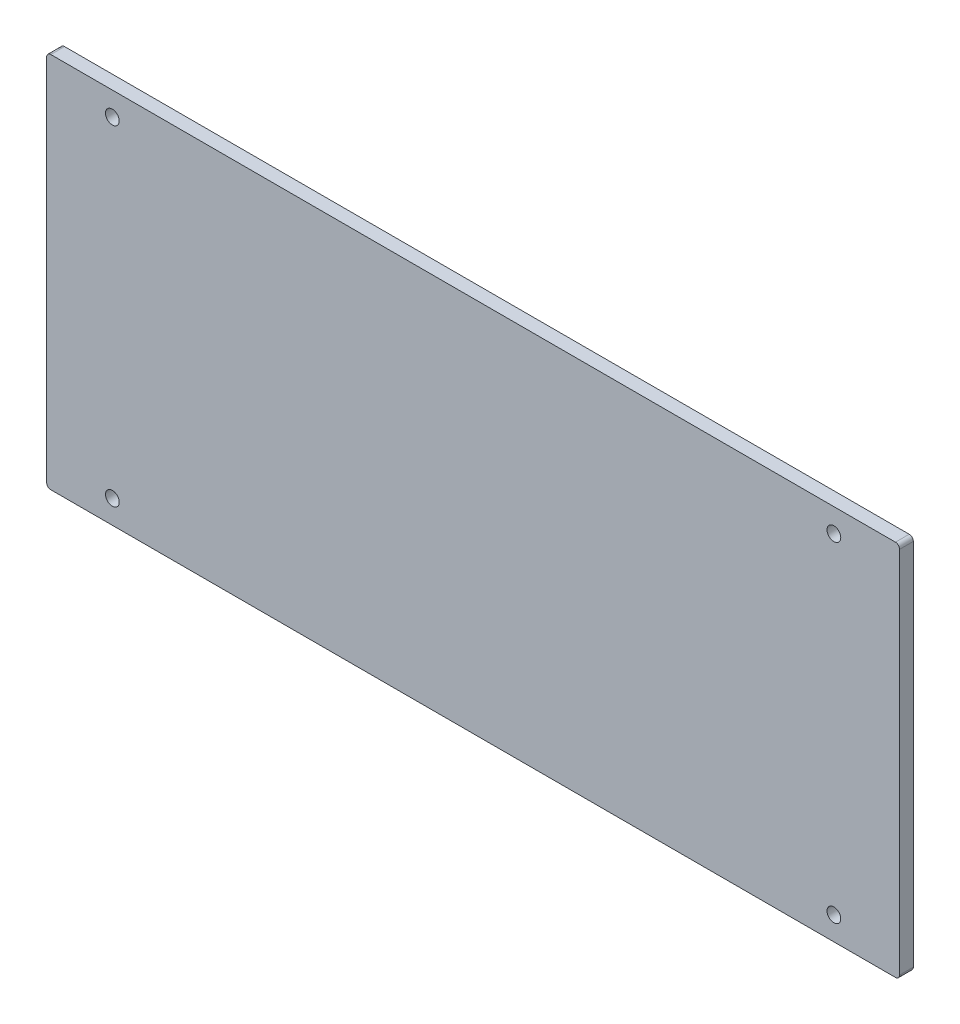
ISO-10303-21;
HEADER;
FILE_DESCRIPTION(('STEP AP214'),'2;1');
FILE_NAME('part.step','',(''),(''),'','','');
FILE_SCHEMA(('AUTOMOTIVE_DESIGN { 1 0 10303 214 1 1 1 1 }'));
ENDSEC;
DATA;
#1=APPLICATION_CONTEXT('core data for automotive mechanical design processes');
#2=APPLICATION_PROTOCOL_DEFINITION('international standard','automotive_design',2000,#1);
#3=PRODUCT_CONTEXT('',#1,'mechanical');
#4=PRODUCT('Part','Part','',(#3));
#5=PRODUCT_RELATED_PRODUCT_CATEGORY('part','',(#4));
#6=PRODUCT_DEFINITION_FORMATION('','',#4);
#7=PRODUCT_DEFINITION_CONTEXT('part definition',#1,'design');
#8=PRODUCT_DEFINITION('design','',#6,#7);
#9=PRODUCT_DEFINITION_SHAPE('','',#8);
#10=(LENGTH_UNIT() NAMED_UNIT(*) SI_UNIT(.MILLI.,.METRE.));
#11=(NAMED_UNIT(*) PLANE_ANGLE_UNIT() SI_UNIT($,.RADIAN.));
#12=(NAMED_UNIT(*) SI_UNIT($,.STERADIAN.) SOLID_ANGLE_UNIT());
#13=UNCERTAINTY_MEASURE_WITH_UNIT(LENGTH_MEASURE(1.E-05),#10,'distance_accuracy_value','');
#14=(GEOMETRIC_REPRESENTATION_CONTEXT(3) GLOBAL_UNCERTAINTY_ASSIGNED_CONTEXT((#13)) GLOBAL_UNIT_ASSIGNED_CONTEXT((#10,
#11,#12)) REPRESENTATION_CONTEXT('',''));
#15=CARTESIAN_POINT('',(0.,0.,0.));
#16=DIRECTION('',(0.,0.,1.));
#17=DIRECTION('',(1.,0.,0.));
#18=AXIS2_PLACEMENT_3D('',#15,#16,#17);
#19=CARTESIAN_POINT('',(-153.5,-67.,5.));
#20=DIRECTION('',(0.,0.,-1.));
#21=DIRECTION('',(-1.,0.,0.));
#22=AXIS2_PLACEMENT_3D('',#19,#20,#21);
#23=CYLINDRICAL_SURFACE('',#22,1.5);
#24=CARTESIAN_POINT('',(-153.5,-67.,0.));
#25=DIRECTION('',(0.,0.,1.));
#26=DIRECTION('',(-1.,0.,0.));
#27=AXIS2_PLACEMENT_3D('',#24,#25,#26);
#28=CIRCLE('',#27,1.5);
#29=CARTESIAN_POINT('',(-155.,-67.,0.));
#30=VERTEX_POINT('',#29);
#31=CARTESIAN_POINT('',(-153.5,-68.5,0.));
#32=VERTEX_POINT('',#31);
#33=EDGE_CURVE('E142',#30,#32,#28,.T.);
#34=ORIENTED_EDGE('',*,*,#33,.T.);
#35=DIRECTION('',(0.,0.,-1.));
#36=VECTOR('',#35,1.);
#37=CARTESIAN_POINT('',(-153.5,-68.5,5.));
#38=LINE('',#37,#36);
#39=CARTESIAN_POINT('',(-153.5,-68.5,5.));
#40=VERTEX_POINT('',#39);
#41=EDGE_CURVE('E11',#40,#32,#38,.T.);
#42=ORIENTED_EDGE('',*,*,#41,.F.);
#43=CARTESIAN_POINT('',(-153.5,-67.,5.));
#44=DIRECTION('',(0.,0.,1.));
#45=DIRECTION('',(-1.,0.,0.));
#46=AXIS2_PLACEMENT_3D('',#43,#44,#45);
#47=CIRCLE('',#46,1.5);
#48=CARTESIAN_POINT('',(-155.,-67.,5.));
#49=VERTEX_POINT('',#48);
#50=EDGE_CURVE('E161',#49,#40,#47,.T.);
#51=ORIENTED_EDGE('',*,*,#50,.F.);
#52=DIRECTION('',(0.,0.,-1.));
#53=VECTOR('',#52,1.);
#54=CARTESIAN_POINT('',(-155.,-67.,5.));
#55=LINE('',#54,#53);
#56=EDGE_CURVE('E138',#49,#30,#55,.T.);
#57=ORIENTED_EDGE('',*,*,#56,.T.);
#58=EDGE_LOOP('',(#34,#42,#51,#57));
#59=FACE_BOUND('',#58,.T.);
#60=ADVANCED_FACE('F39',(#59),#23,.T.);
#61=CARTESIAN_POINT('',(-153.5,-68.5,5.));
#62=DIRECTION('',(0.,1.,0.));
#63=DIRECTION('',(0.,0.,1.));
#64=AXIS2_PLACEMENT_3D('',#61,#62,#63);
#65=PLANE('',#64);
#66=DIRECTION('',(1.,0.,0.));
#67=VECTOR('',#66,1.);
#68=CARTESIAN_POINT('',(-153.5,-68.5,0.));
#69=LINE('',#68,#67);
#70=CARTESIAN_POINT('',(153.5,-68.5,0.));
#71=VERTEX_POINT('',#70);
#72=EDGE_CURVE('E146',#32,#71,#69,.T.);
#73=ORIENTED_EDGE('',*,*,#72,.T.);
#74=DIRECTION('',(0.,0.,-1.));
#75=VECTOR('',#74,1.);
#76=CARTESIAN_POINT('',(153.5,-68.5,5.));
#77=LINE('',#76,#75);
#78=CARTESIAN_POINT('',(153.5,-68.5,5.));
#79=VERTEX_POINT('',#78);
#80=EDGE_CURVE('E48',#79,#71,#77,.T.);
#81=ORIENTED_EDGE('',*,*,#80,.F.);
#82=DIRECTION('',(1.,0.,0.));
#83=VECTOR('',#82,1.);
#84=CARTESIAN_POINT('',(-153.5,-68.5,5.));
#85=LINE('',#84,#83);
#86=EDGE_CURVE('E103',#40,#79,#85,.T.);
#87=ORIENTED_EDGE('',*,*,#86,.F.);
#88=ORIENTED_EDGE('',*,*,#41,.T.);
#89=EDGE_LOOP('',(#73,#81,#87,#88));
#90=FACE_BOUND('',#89,.T.);
#91=ADVANCED_FACE('F248',(#90),#65,.F.);
#92=CARTESIAN_POINT('',(153.5,-67.,5.));
#93=DIRECTION('',(0.,0.,-1.));
#94=DIRECTION('',(-1.,0.,0.));
#95=AXIS2_PLACEMENT_3D('',#92,#93,#94);
#96=CYLINDRICAL_SURFACE('',#95,1.5);
#97=CARTESIAN_POINT('',(153.5,-67.,0.));
#98=DIRECTION('',(0.,0.,1.));
#99=DIRECTION('',(1.,0.,0.));
#100=AXIS2_PLACEMENT_3D('',#97,#98,#99);
#101=CIRCLE('',#100,1.5);
#102=CARTESIAN_POINT('',(155.,-67.,0.));
#103=VERTEX_POINT('',#102);
#104=EDGE_CURVE('E150',#71,#103,#101,.T.);
#105=ORIENTED_EDGE('',*,*,#104,.T.);
#106=DIRECTION('',(0.,0.,-1.));
#107=VECTOR('',#106,1.);
#108=CARTESIAN_POINT('',(155.,-67.,5.));
#109=LINE('',#108,#107);
#110=CARTESIAN_POINT('',(155.,-67.,5.));
#111=VERTEX_POINT('',#110);
#112=EDGE_CURVE('E169',#111,#103,#109,.T.);
#113=ORIENTED_EDGE('',*,*,#112,.F.);
#114=CARTESIAN_POINT('',(153.5,-67.,5.));
#115=DIRECTION('',(0.,0.,1.));
#116=DIRECTION('',(1.,0.,0.));
#117=AXIS2_PLACEMENT_3D('',#114,#115,#116);
#118=CIRCLE('',#117,1.5);
#119=EDGE_CURVE('E177',#79,#111,#118,.T.);
#120=ORIENTED_EDGE('',*,*,#119,.F.);
#121=ORIENTED_EDGE('',*,*,#80,.T.);
#122=EDGE_LOOP('',(#105,#113,#120,#121));
#123=FACE_BOUND('',#122,.T.);
#124=ADVANCED_FACE('F175',(#123),#96,.T.);
#125=CARTESIAN_POINT('',(155.,-67.,5.));
#126=DIRECTION('',(-1.,0.,0.));
#127=DIRECTION('',(0.,0.,1.));
#128=AXIS2_PLACEMENT_3D('',#125,#126,#127);
#129=PLANE('',#128);
#130=DIRECTION('',(0.,1.,0.));
#131=VECTOR('',#130,1.);
#132=CARTESIAN_POINT('',(155.,-67.,0.));
#133=LINE('',#132,#131);
#134=CARTESIAN_POINT('',(155.,67.,0.));
#135=VERTEX_POINT('',#134);
#136=EDGE_CURVE('E152',#103,#135,#133,.T.);
#137=ORIENTED_EDGE('',*,*,#136,.T.);
#138=DIRECTION('',(0.,0.,-1.));
#139=VECTOR('',#138,1.);
#140=CARTESIAN_POINT('',(155.,67.,5.));
#141=LINE('',#140,#139);
#142=CARTESIAN_POINT('',(155.,67.,5.));
#143=VERTEX_POINT('',#142);
#144=EDGE_CURVE('E166',#143,#135,#141,.T.);
#145=ORIENTED_EDGE('',*,*,#144,.F.);
#146=DIRECTION('',(0.,1.,0.));
#147=VECTOR('',#146,1.);
#148=CARTESIAN_POINT('',(155.,-67.,5.));
#149=LINE('',#148,#147);
#150=EDGE_CURVE('E189',#111,#143,#149,.T.);
#151=ORIENTED_EDGE('',*,*,#150,.F.);
#152=ORIENTED_EDGE('',*,*,#112,.T.);
#153=EDGE_LOOP('',(#137,#145,#151,#152));
#154=FACE_BOUND('',#153,.T.);
#155=ADVANCED_FACE('F185',(#154),#129,.F.);
#156=CARTESIAN_POINT('',(153.5,67.,5.));
#157=DIRECTION('',(0.,0.,-1.));
#158=DIRECTION('',(-1.,0.,0.));
#159=AXIS2_PLACEMENT_3D('',#156,#157,#158);
#160=CYLINDRICAL_SURFACE('',#159,1.5);
#161=CARTESIAN_POINT('',(153.5,67.,0.));
#162=DIRECTION('',(0.,0.,1.));
#163=DIRECTION('',(-1.,0.,0.));
#164=AXIS2_PLACEMENT_3D('',#161,#162,#163);
#165=CIRCLE('',#164,1.5);
#166=CARTESIAN_POINT('',(153.5,68.5,0.));
#167=VERTEX_POINT('',#166);
#168=EDGE_CURVE('E154',#135,#167,#165,.T.);
#169=ORIENTED_EDGE('',*,*,#168,.T.);
#170=DIRECTION('',(0.,0.,-1.));
#171=VECTOR('',#170,1.);
#172=CARTESIAN_POINT('',(153.5,68.5,5.));
#173=LINE('',#172,#171);
#174=CARTESIAN_POINT('',(153.5,68.5,5.));
#175=VERTEX_POINT('',#174);
#176=EDGE_CURVE('E132',#175,#167,#173,.T.);
#177=ORIENTED_EDGE('',*,*,#176,.F.);
#178=CARTESIAN_POINT('',(153.5,67.,5.));
#179=DIRECTION('',(0.,0.,1.));
#180=DIRECTION('',(-1.,0.,0.));
#181=AXIS2_PLACEMENT_3D('',#178,#179,#180);
#182=CIRCLE('',#181,1.5);
#183=EDGE_CURVE('E122',#143,#175,#182,.T.);
#184=ORIENTED_EDGE('',*,*,#183,.F.);
#185=ORIENTED_EDGE('',*,*,#144,.T.);
#186=EDGE_LOOP('',(#169,#177,#184,#185));
#187=FACE_BOUND('',#186,.T.);
#188=ADVANCED_FACE('F188',(#187),#160,.T.);
#189=CARTESIAN_POINT('',(-153.5,68.5,5.));
#190=DIRECTION('',(0.,-1.,0.));
#191=DIRECTION('',(0.,0.,-1.));
#192=AXIS2_PLACEMENT_3D('',#189,#190,#191);
#193=PLANE('',#192);
#194=DIRECTION('',(-1.,0.,0.));
#195=VECTOR('',#194,1.);
#196=CARTESIAN_POINT('',(-153.5,68.5,0.));
#197=LINE('',#196,#195);
#198=CARTESIAN_POINT('',(-153.5,68.5,0.));
#199=VERTEX_POINT('',#198);
#200=EDGE_CURVE('E131',#167,#199,#197,.T.);
#201=ORIENTED_EDGE('',*,*,#200,.T.);
#202=DIRECTION('',(0.,0.,-1.));
#203=VECTOR('',#202,1.);
#204=CARTESIAN_POINT('',(-153.5,68.5,5.));
#205=LINE('',#204,#203);
#206=CARTESIAN_POINT('',(-153.5,68.5,5.));
#207=VERTEX_POINT('',#206);
#208=EDGE_CURVE('E128',#207,#199,#205,.T.);
#209=ORIENTED_EDGE('',*,*,#208,.F.);
#210=DIRECTION('',(-1.,0.,0.));
#211=VECTOR('',#210,1.);
#212=CARTESIAN_POINT('',(-153.5,68.5,5.));
#213=LINE('',#212,#211);
#214=EDGE_CURVE('E116',#175,#207,#213,.T.);
#215=ORIENTED_EDGE('',*,*,#214,.F.);
#216=ORIENTED_EDGE('',*,*,#176,.T.);
#217=EDGE_LOOP('',(#201,#209,#215,#216));
#218=FACE_BOUND('',#217,.T.);
#219=ADVANCED_FACE('F129',(#218),#193,.F.);
#220=CARTESIAN_POINT('',(-153.5,67.,5.));
#221=DIRECTION('',(0.,0.,-1.));
#222=DIRECTION('',(-1.,0.,0.));
#223=AXIS2_PLACEMENT_3D('',#220,#221,#222);
#224=CYLINDRICAL_SURFACE('',#223,1.5);
#225=CARTESIAN_POINT('',(-153.5,67.,0.));
#226=DIRECTION('',(0.,0.,1.));
#227=DIRECTION('',(-1.,0.,0.));
#228=AXIS2_PLACEMENT_3D('',#225,#226,#227);
#229=CIRCLE('',#228,1.5);
#230=CARTESIAN_POINT('',(-155.,67.,0.));
#231=VERTEX_POINT('',#230);
#232=EDGE_CURVE('E88',#199,#231,#229,.T.);
#233=ORIENTED_EDGE('',*,*,#232,.T.);
#234=DIRECTION('',(0.,0.,-1.));
#235=VECTOR('',#234,1.);
#236=CARTESIAN_POINT('',(-155.,67.,5.));
#237=LINE('',#236,#235);
#238=CARTESIAN_POINT('',(-155.,67.,5.));
#239=VERTEX_POINT('',#238);
#240=EDGE_CURVE('E133',#239,#231,#237,.T.);
#241=ORIENTED_EDGE('',*,*,#240,.F.);
#242=CARTESIAN_POINT('',(-153.5,67.,5.));
#243=DIRECTION('',(0.,0.,1.));
#244=DIRECTION('',(-1.,0.,0.));
#245=AXIS2_PLACEMENT_3D('',#242,#243,#244);
#246=CIRCLE('',#245,1.5);
#247=EDGE_CURVE('E120',#207,#239,#246,.T.);
#248=ORIENTED_EDGE('',*,*,#247,.F.);
#249=ORIENTED_EDGE('',*,*,#208,.T.);
#250=EDGE_LOOP('',(#233,#241,#248,#249));
#251=FACE_BOUND('',#250,.T.);
#252=ADVANCED_FACE('F135',(#251),#224,.T.);
#253=CARTESIAN_POINT('',(-155.,-67.,5.));
#254=DIRECTION('',(1.,0.,0.));
#255=DIRECTION('',(0.,0.,-1.));
#256=AXIS2_PLACEMENT_3D('',#253,#254,#255);
#257=PLANE('',#256);
#258=DIRECTION('',(0.,-1.,0.));
#259=VECTOR('',#258,1.);
#260=CARTESIAN_POINT('',(-155.,-67.,0.));
#261=LINE('',#260,#259);
#262=EDGE_CURVE('E95',#231,#30,#261,.T.);
#263=ORIENTED_EDGE('',*,*,#262,.T.);
#264=ORIENTED_EDGE('',*,*,#56,.F.);
#265=DIRECTION('',(0.,-1.,0.));
#266=VECTOR('',#265,1.);
#267=CARTESIAN_POINT('',(-155.,-67.,5.));
#268=LINE('',#267,#266);
#269=EDGE_CURVE('E59',#239,#49,#268,.T.);
#270=ORIENTED_EDGE('',*,*,#269,.F.);
#271=ORIENTED_EDGE('',*,*,#240,.T.);
#272=EDGE_LOOP('',(#263,#264,#270,#271));
#273=FACE_BOUND('',#272,.T.);
#274=ADVANCED_FACE('F255',(#273),#257,.F.);
#275=CARTESIAN_POINT('',(-153.5,-67.,5.));
#276=DIRECTION('',(0.,0.,-1.));
#277=DIRECTION('',(-1.,0.,0.));
#278=AXIS2_PLACEMENT_3D('',#275,#276,#277);
#279=PLANE('',#278);
#280=CARTESIAN_POINT('',(-131.119201541393,-60.0000000000007,5.));
#281=DIRECTION('',(0.,0.,-1.));
#282=DIRECTION('',(1.,0.,0.));
#283=AXIS2_PLACEMENT_3D('',#280,#281,#282);
#284=CIRCLE('',#283,2.49999999999936);
#285=CARTESIAN_POINT('',(-128.619201541394,-60.0000000000007,5.));
#286=VERTEX_POINT('',#285);
#287=EDGE_CURVE('E207',#286,#286,#284,.T.);
#288=ORIENTED_EDGE('',*,*,#287,.T.);
#289=EDGE_LOOP('',(#288));
#290=FACE_BOUND('',#289,.T.);
#291=CARTESIAN_POINT('',(-131.119201541393,60.0000000000007,5.));
#292=DIRECTION('',(0.,0.,-1.));
#293=DIRECTION('',(-1.,0.,0.));
#294=AXIS2_PLACEMENT_3D('',#291,#292,#293);
#295=CIRCLE('',#294,2.50000000000064);
#296=CARTESIAN_POINT('',(-133.619201541394,60.0000000000007,5.));
#297=VERTEX_POINT('',#296);
#298=EDGE_CURVE('E214',#297,#297,#295,.T.);
#299=ORIENTED_EDGE('',*,*,#298,.T.);
#300=EDGE_LOOP('',(#299));
#301=FACE_BOUND('',#300,.T.);
#302=CARTESIAN_POINT('',(131.119201541393,60.0000000000007,5.));
#303=DIRECTION('',(0.,0.,-1.));
#304=DIRECTION('',(1.,0.,0.));
#305=AXIS2_PLACEMENT_3D('',#302,#303,#304);
#306=CIRCLE('',#305,2.5);
#307=CARTESIAN_POINT('',(133.619201541393,60.0000000000007,5.));
#308=VERTEX_POINT('',#307);
#309=EDGE_CURVE('E200',#308,#308,#306,.T.);
#310=ORIENTED_EDGE('',*,*,#309,.T.);
#311=EDGE_LOOP('',(#310));
#312=FACE_BOUND('',#311,.T.);
#313=CARTESIAN_POINT('',(131.119201541393,-60.0000000000006,5.));
#314=DIRECTION('',(0.,0.,-1.));
#315=DIRECTION('',(-1.,0.,0.));
#316=AXIS2_PLACEMENT_3D('',#313,#314,#315);
#317=CIRCLE('',#316,2.5);
#318=CARTESIAN_POINT('',(128.619201541393,-60.0000000000006,5.));
#319=VERTEX_POINT('',#318);
#320=EDGE_CURVE('E147',#319,#319,#317,.T.);
#321=ORIENTED_EDGE('',*,*,#320,.T.);
#322=EDGE_LOOP('',(#321));
#323=FACE_BOUND('',#322,.T.);
#324=ORIENTED_EDGE('',*,*,#50,.T.);
#325=ORIENTED_EDGE('',*,*,#86,.T.);
#326=ORIENTED_EDGE('',*,*,#119,.T.);
#327=ORIENTED_EDGE('',*,*,#150,.T.);
#328=ORIENTED_EDGE('',*,*,#183,.T.);
#329=ORIENTED_EDGE('',*,*,#214,.T.);
#330=ORIENTED_EDGE('',*,*,#247,.T.);
#331=ORIENTED_EDGE('',*,*,#269,.T.);
#332=EDGE_LOOP('',(#324,#325,#326,#327,#328,#329,#330,#331));
#333=FACE_BOUND('',#332,.T.);
#334=ADVANCED_FACE('F118',(#290,#301,#312,#323,#333),#279,.F.);
#335=CARTESIAN_POINT('',(-153.5,-67.,0.));
#336=DIRECTION('',(0.,0.,-1.));
#337=DIRECTION('',(-1.,0.,0.));
#338=AXIS2_PLACEMENT_3D('',#335,#336,#337);
#339=PLANE('',#338);
#340=CARTESIAN_POINT('',(-131.119201541393,-60.0000000000007,0.));
#341=DIRECTION('',(0.,0.,-1.));
#342=DIRECTION('',(1.,0.,0.));
#343=AXIS2_PLACEMENT_3D('',#340,#341,#342);
#344=CIRCLE('',#343,2.49999999999936);
#345=CARTESIAN_POINT('',(-128.619201541394,-60.0000000000007,0.));
#346=VERTEX_POINT('',#345);
#347=EDGE_CURVE('E203',#346,#346,#344,.T.);
#348=ORIENTED_EDGE('',*,*,#347,.F.);
#349=EDGE_LOOP('',(#348));
#350=FACE_BOUND('',#349,.T.);
#351=CARTESIAN_POINT('',(-131.119201541393,60.0000000000007,0.));
#352=DIRECTION('',(0.,0.,-1.));
#353=DIRECTION('',(-1.,0.,0.));
#354=AXIS2_PLACEMENT_3D('',#351,#352,#353);
#355=CIRCLE('',#354,2.50000000000064);
#356=CARTESIAN_POINT('',(-133.619201541394,60.0000000000007,0.));
#357=VERTEX_POINT('',#356);
#358=EDGE_CURVE('E211',#357,#357,#355,.T.);
#359=ORIENTED_EDGE('',*,*,#358,.F.);
#360=EDGE_LOOP('',(#359));
#361=FACE_BOUND('',#360,.T.);
#362=CARTESIAN_POINT('',(131.119201541393,60.0000000000007,0.));
#363=DIRECTION('',(0.,0.,-1.));
#364=DIRECTION('',(1.,0.,0.));
#365=AXIS2_PLACEMENT_3D('',#362,#363,#364);
#366=CIRCLE('',#365,2.5);
#367=CARTESIAN_POINT('',(133.619201541393,60.0000000000007,0.));
#368=VERTEX_POINT('',#367);
#369=EDGE_CURVE('E217',#368,#368,#366,.T.);
#370=ORIENTED_EDGE('',*,*,#369,.F.);
#371=EDGE_LOOP('',(#370));
#372=FACE_BOUND('',#371,.T.);
#373=CARTESIAN_POINT('',(131.119201541393,-60.0000000000006,0.));
#374=DIRECTION('',(0.,0.,-1.));
#375=DIRECTION('',(-1.,0.,0.));
#376=AXIS2_PLACEMENT_3D('',#373,#374,#375);
#377=CIRCLE('',#376,2.5);
#378=CARTESIAN_POINT('',(128.619201541393,-60.0000000000006,0.));
#379=VERTEX_POINT('',#378);
#380=EDGE_CURVE('E197',#379,#379,#377,.T.);
#381=ORIENTED_EDGE('',*,*,#380,.F.);
#382=EDGE_LOOP('',(#381));
#383=FACE_BOUND('',#382,.T.);
#384=ORIENTED_EDGE('',*,*,#33,.F.);
#385=ORIENTED_EDGE('',*,*,#262,.F.);
#386=ORIENTED_EDGE('',*,*,#232,.F.);
#387=ORIENTED_EDGE('',*,*,#200,.F.);
#388=ORIENTED_EDGE('',*,*,#168,.F.);
#389=ORIENTED_EDGE('',*,*,#136,.F.);
#390=ORIENTED_EDGE('',*,*,#104,.F.);
#391=ORIENTED_EDGE('',*,*,#72,.F.);
#392=EDGE_LOOP('',(#384,#385,#386,#387,#388,#389,#390,#391));
#393=FACE_BOUND('',#392,.T.);
#394=ADVANCED_FACE('F181',(#350,#361,#372,#383,#393),#339,.T.);
#395=CARTESIAN_POINT('',(131.119201541393,-60.0000000000006,5.));
#396=DIRECTION('',(0.,0.,-1.));
#397=DIRECTION('',(-1.,0.,0.));
#398=AXIS2_PLACEMENT_3D('',#395,#396,#397);
#399=CYLINDRICAL_SURFACE('',#398,2.5);
#400=ORIENTED_EDGE('',*,*,#320,.F.);
#401=EDGE_LOOP('',(#400));
#402=FACE_BOUND('',#401,.T.);
#403=ORIENTED_EDGE('',*,*,#380,.T.);
#404=EDGE_LOOP('',(#403));
#405=FACE_BOUND('',#404,.T.);
#406=ADVANCED_FACE('F229',(#402,#405),#399,.F.);
#407=CARTESIAN_POINT('',(131.119201541393,60.0000000000007,5.));
#408=DIRECTION('',(0.,0.,-1.));
#409=DIRECTION('',(-1.,0.,0.));
#410=AXIS2_PLACEMENT_3D('',#407,#408,#409);
#411=CYLINDRICAL_SURFACE('',#410,2.5);
#412=ORIENTED_EDGE('',*,*,#309,.F.);
#413=EDGE_LOOP('',(#412));
#414=FACE_BOUND('',#413,.T.);
#415=ORIENTED_EDGE('',*,*,#369,.T.);
#416=EDGE_LOOP('',(#415));
#417=FACE_BOUND('',#416,.T.);
#418=ADVANCED_FACE('F225',(#414,#417),#411,.F.);
#419=CARTESIAN_POINT('',(-131.119201541393,60.0000000000007,5.));
#420=DIRECTION('',(0.,0.,-1.));
#421=DIRECTION('',(-1.,0.,0.));
#422=AXIS2_PLACEMENT_3D('',#419,#420,#421);
#423=CYLINDRICAL_SURFACE('',#422,2.50000000000064);
#424=ORIENTED_EDGE('',*,*,#298,.F.);
#425=EDGE_LOOP('',(#424));
#426=FACE_BOUND('',#425,.T.);
#427=ORIENTED_EDGE('',*,*,#358,.T.);
#428=EDGE_LOOP('',(#427));
#429=FACE_BOUND('',#428,.T.);
#430=ADVANCED_FACE('F228',(#426,#429),#423,.F.);
#431=CARTESIAN_POINT('',(-131.119201541393,-60.0000000000007,5.));
#432=DIRECTION('',(0.,0.,-1.));
#433=DIRECTION('',(-1.,0.,0.));
#434=AXIS2_PLACEMENT_3D('',#431,#432,#433);
#435=CYLINDRICAL_SURFACE('',#434,2.49999999999936);
#436=ORIENTED_EDGE('',*,*,#287,.F.);
#437=EDGE_LOOP('',(#436));
#438=FACE_BOUND('',#437,.T.);
#439=ORIENTED_EDGE('',*,*,#347,.T.);
#440=EDGE_LOOP('',(#439));
#441=FACE_BOUND('',#440,.T.);
#442=ADVANCED_FACE('F330',(#438,#441),#435,.F.);
#443=CLOSED_SHELL('',(#60,#91,#124,#155,#188,#219,#252,#274,#334,#394,#406,#418,#430,#442));
#444=MANIFOLD_SOLID_BREP('B2',#443);
#445=ADVANCED_BREP_SHAPE_REPRESENTATION('',(#18,#444),#14);
#446=SHAPE_DEFINITION_REPRESENTATION(#9,#445);
ENDSEC;
END-ISO-10303-21;
